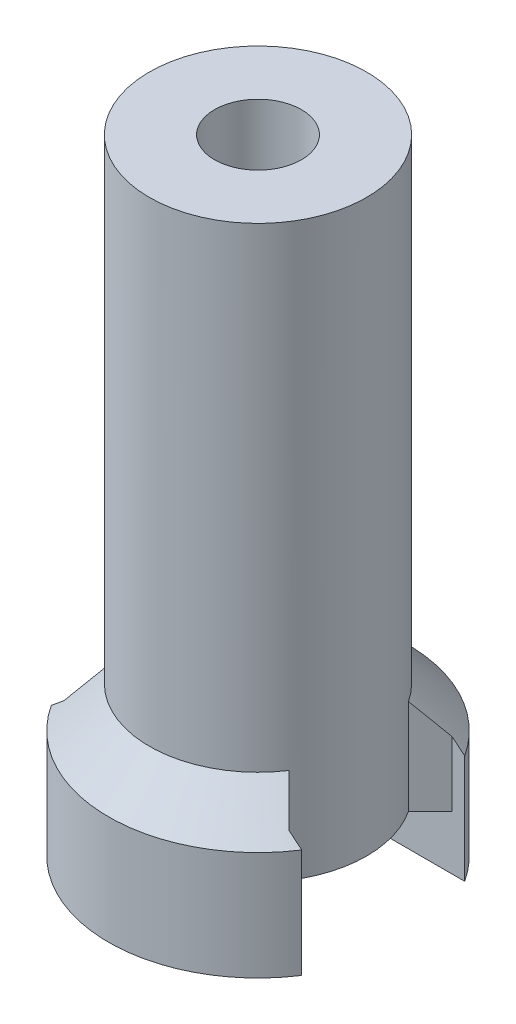
ISO-10303-21;
HEADER;
FILE_DESCRIPTION(('STEP AP214'),'2;1');
FILE_NAME('part.step','',(''),(''),'','','');
FILE_SCHEMA(('AUTOMOTIVE_DESIGN { 1 0 10303 214 1 1 1 1 }'));
ENDSEC;
DATA;
#1=APPLICATION_CONTEXT('core data for automotive mechanical design processes');
#2=APPLICATION_PROTOCOL_DEFINITION('international standard','automotive_design',2000,#1);
#3=PRODUCT_CONTEXT('',#1,'mechanical');
#4=PRODUCT('Part','Part','',(#3));
#5=PRODUCT_RELATED_PRODUCT_CATEGORY('part','',(#4));
#6=PRODUCT_DEFINITION_FORMATION('','',#4);
#7=PRODUCT_DEFINITION_CONTEXT('part definition',#1,'design');
#8=PRODUCT_DEFINITION('design','',#6,#7);
#9=PRODUCT_DEFINITION_SHAPE('','',#8);
#10=(LENGTH_UNIT() NAMED_UNIT(*) SI_UNIT(.MILLI.,.METRE.));
#11=(NAMED_UNIT(*) PLANE_ANGLE_UNIT() SI_UNIT($,.RADIAN.));
#12=(NAMED_UNIT(*) SI_UNIT($,.STERADIAN.) SOLID_ANGLE_UNIT());
#13=UNCERTAINTY_MEASURE_WITH_UNIT(LENGTH_MEASURE(1.E-05),#10,'distance_accuracy_value','');
#14=(GEOMETRIC_REPRESENTATION_CONTEXT(3) GLOBAL_UNCERTAINTY_ASSIGNED_CONTEXT((#13)) GLOBAL_UNIT_ASSIGNED_CONTEXT((#10,
#11,#12)) REPRESENTATION_CONTEXT('',''));
#15=CARTESIAN_POINT('',(0.,0.,0.));
#16=DIRECTION('',(0.,0.,1.));
#17=DIRECTION('',(1.,0.,0.));
#18=AXIS2_PLACEMENT_3D('',#15,#16,#17);
#19=CARTESIAN_POINT('',(0.,0.,0.));
#20=DIRECTION('',(0.,1.,0.));
#21=DIRECTION('',(0.,0.,1.));
#22=AXIS2_PLACEMENT_3D('',#19,#20,#21);
#23=PLANE('',#22);
#24=DIRECTION('',(-1.,0.,0.));
#25=VECTOR('',#24,1.);
#26=CARTESIAN_POINT('',(-6.77796610169491,0.,3.));
#27=LINE('',#26,#25);
#28=CARTESIAN_POINT('',(4.60977222864644,0.,3.));
#29=VERTEX_POINT('',#28);
#30=CARTESIAN_POINT('',(-4.60977222864644,0.,3.));
#31=VERTEX_POINT('',#30);
#32=EDGE_CURVE('E146',#29,#31,#27,.T.);
#33=ORIENTED_EDGE('',*,*,#32,.F.);
#34=CARTESIAN_POINT('',(0.,0.,0.));
#35=DIRECTION('',(0.,-1.,0.));
#36=DIRECTION('',(0.,0.,-1.));
#37=AXIS2_PLACEMENT_3D('',#34,#35,#36);
#38=CIRCLE('',#37,5.5);
#39=EDGE_CURVE('E149',#29,#31,#38,.T.);
#40=ORIENTED_EDGE('',*,*,#39,.T.);
#41=EDGE_LOOP('',(#33,#40));
#42=FACE_BOUND('',#41,.T.);
#43=ADVANCED_FACE('F47',(#42),#23,.F.);
#44=CARTESIAN_POINT('',(0.,23.,0.));
#45=DIRECTION('',(0.,-1.,0.));
#46=DIRECTION('',(0.,0.,-1.));
#47=AXIS2_PLACEMENT_3D('',#44,#45,#46);
#48=CYLINDRICAL_SURFACE('',#47,1.6);
#49=CARTESIAN_POINT('',(0.,23.,0.));
#50=DIRECTION('',(0.,1.,0.));
#51=DIRECTION('',(0.,0.,1.));
#52=AXIS2_PLACEMENT_3D('',#49,#50,#51);
#53=CIRCLE('',#52,1.6);
#54=CARTESIAN_POINT('',(0.,23.,1.6));
#55=VERTEX_POINT('',#54);
#56=EDGE_CURVE('E207',#55,#55,#53,.T.);
#57=ORIENTED_EDGE('',*,*,#56,.T.);
#58=EDGE_LOOP('',(#57));
#59=FACE_BOUND('',#58,.T.);
#60=CARTESIAN_POINT('',(0.,2.,0.));
#61=DIRECTION('',(0.,-1.,0.));
#62=DIRECTION('',(0.,0.,-1.));
#63=AXIS2_PLACEMENT_3D('',#60,#61,#62);
#64=CIRCLE('',#63,1.6);
#65=CARTESIAN_POINT('',(0.,2.,-1.6));
#66=VERTEX_POINT('',#65);
#67=EDGE_CURVE('E188',#66,#66,#64,.T.);
#68=ORIENTED_EDGE('',*,*,#67,.T.);
#69=EDGE_LOOP('',(#68));
#70=FACE_BOUND('',#69,.T.);
#71=ADVANCED_FACE('F346',(#59,#70),#48,.F.);
#72=CARTESIAN_POINT('',(0.,23.,0.));
#73=DIRECTION('',(0.,1.,0.));
#74=DIRECTION('',(0.,0.,1.));
#75=AXIS2_PLACEMENT_3D('',#72,#73,#74);
#76=PLANE('',#75);
#77=CARTESIAN_POINT('',(0.,23.,0.));
#78=DIRECTION('',(0.,1.,0.));
#79=DIRECTION('',(0.,0.,1.));
#80=AXIS2_PLACEMENT_3D('',#77,#78,#79);
#81=CIRCLE('',#80,4.);
#82=CARTESIAN_POINT('',(0.,23.,4.));
#83=VERTEX_POINT('',#82);
#84=EDGE_CURVE('E211',#83,#83,#81,.T.);
#85=ORIENTED_EDGE('',*,*,#84,.T.);
#86=EDGE_LOOP('',(#85));
#87=FACE_BOUND('',#86,.T.);
#88=ORIENTED_EDGE('',*,*,#56,.F.);
#89=EDGE_LOOP('',(#88));
#90=FACE_BOUND('',#89,.T.);
#91=ADVANCED_FACE('F350',(#87,#90),#76,.T.);
#92=DIRECTION('',(1.,0.,0.));
#93=VECTOR('',#92,1.);
#94=CARTESIAN_POINT('',(-6.77796610169491,0.,-3.));
#95=LINE('',#94,#93);
#96=CARTESIAN_POINT('',(-4.60977222864644,0.,-3.));
#97=VERTEX_POINT('',#96);
#98=CARTESIAN_POINT('',(4.60977222864644,0.,-3.));
#99=VERTEX_POINT('',#98);
#100=EDGE_CURVE('E153',#97,#99,#95,.T.);
#101=ORIENTED_EDGE('',*,*,#100,.F.);
#102=CARTESIAN_POINT('',(0.,0.,0.));
#103=DIRECTION('',(0.,-1.,0.));
#104=DIRECTION('',(0.,0.,-1.));
#105=AXIS2_PLACEMENT_3D('',#102,#103,#104);
#106=CIRCLE('',#105,5.5);
#107=EDGE_CURVE('E169',#97,#99,#106,.T.);
#108=ORIENTED_EDGE('',*,*,#107,.T.);
#109=EDGE_LOOP('',(#101,#108));
#110=FACE_BOUND('',#109,.T.);
#111=ADVANCED_FACE('F353',(#110),#23,.F.);
#112=CARTESIAN_POINT('',(0.,23.,0.));
#113=DIRECTION('',(0.,-1.,0.));
#114=DIRECTION('',(0.,0.,-1.));
#115=AXIS2_PLACEMENT_3D('',#112,#113,#114);
#116=CYLINDRICAL_SURFACE('',#115,4.);
#117=CARTESIAN_POINT('',(0.,2.,0.));
#118=DIRECTION('',(0.,-1.,0.));
#119=DIRECTION('',(0.,0.,-1.));
#120=AXIS2_PLACEMENT_3D('',#117,#118,#119);
#121=CIRCLE('',#120,4.);
#122=CARTESIAN_POINT('',(-3.34267952644057,2.,2.19692821537597));
#123=VERTEX_POINT('',#122);
#124=CARTESIAN_POINT('',(-3.34267952644057,2.,-2.19692821537597));
#125=VERTEX_POINT('',#124);
#126=EDGE_CURVE('E200',#123,#125,#121,.T.);
#127=ORIENTED_EDGE('',*,*,#126,.F.);
#128=DIRECTION('',(0.,-1.,0.));
#129=VECTOR('',#128,1.);
#130=CARTESIAN_POINT('',(-3.34267952644057,23.,2.19692821537597));
#131=LINE('',#130,#129);
#132=CARTESIAN_POINT('',(-3.34267952644057,5.5,2.19692821537597));
#133=VERTEX_POINT('',#132);
#134=EDGE_CURVE('E231',#123,#133,#131,.F.);
#135=ORIENTED_EDGE('',*,*,#134,.T.);
#136=CARTESIAN_POINT('',(0.,5.5,0.));
#137=DIRECTION('',(0.,-1.,0.));
#138=DIRECTION('',(0.,0.,-1.));
#139=AXIS2_PLACEMENT_3D('',#136,#137,#138);
#140=CIRCLE('',#139,4.);
#141=CARTESIAN_POINT('',(3.34267952644057,5.5,2.19692821537597));
#142=VERTEX_POINT('',#141);
#143=EDGE_CURVE('E225',#133,#142,#140,.F.);
#144=ORIENTED_EDGE('',*,*,#143,.T.);
#145=DIRECTION('',(0.,-1.,0.));
#146=VECTOR('',#145,1.);
#147=CARTESIAN_POINT('',(3.34267952644057,23.,2.19692821537597));
#148=LINE('',#147,#146);
#149=CARTESIAN_POINT('',(3.34267952644057,2.,2.19692821537597));
#150=VERTEX_POINT('',#149);
#151=EDGE_CURVE('E228',#142,#150,#148,.T.);
#152=ORIENTED_EDGE('',*,*,#151,.T.);
#153=CARTESIAN_POINT('',(3.34267952644057,2.,-2.19692821537597));
#154=VERTEX_POINT('',#153);
#155=EDGE_CURVE('E206',#154,#150,#121,.T.);
#156=ORIENTED_EDGE('',*,*,#155,.F.);
#157=DIRECTION('',(0.,-1.,0.));
#158=VECTOR('',#157,1.);
#159=CARTESIAN_POINT('',(3.34267952644057,23.,-2.19692821537597));
#160=LINE('',#159,#158);
#161=CARTESIAN_POINT('',(3.34267952644057,5.5,-2.19692821537597));
#162=VERTEX_POINT('',#161);
#163=EDGE_CURVE('E218',#154,#162,#160,.F.);
#164=ORIENTED_EDGE('',*,*,#163,.T.);
#165=CARTESIAN_POINT('',(0.,5.5,0.));
#166=DIRECTION('',(0.,-1.,0.));
#167=DIRECTION('',(0.,0.,-1.));
#168=AXIS2_PLACEMENT_3D('',#165,#166,#167);
#169=CIRCLE('',#168,4.);
#170=CARTESIAN_POINT('',(-3.34267952644057,5.5,-2.19692821537597));
#171=VERTEX_POINT('',#170);
#172=EDGE_CURVE('E215',#162,#171,#169,.F.);
#173=ORIENTED_EDGE('',*,*,#172,.T.);
#174=DIRECTION('',(0.,-1.,0.));
#175=VECTOR('',#174,1.);
#176=CARTESIAN_POINT('',(-3.34267952644057,23.,-2.19692821537597));
#177=LINE('',#176,#175);
#178=EDGE_CURVE('E221',#171,#125,#177,.T.);
#179=ORIENTED_EDGE('',*,*,#178,.T.);
#180=EDGE_LOOP('',(#127,#135,#144,#152,#156,#164,#173,#179));
#181=FACE_BOUND('',#180,.T.);
#182=ORIENTED_EDGE('',*,*,#84,.F.);
#183=EDGE_LOOP('',(#182));
#184=FACE_BOUND('',#183,.T.);
#185=ADVANCED_FACE('F325',(#181,#184),#116,.T.);
#186=CARTESIAN_POINT('',(-6.77796610169491,2.,3.));
#187=DIRECTION('',(0.,0.,1.));
#188=DIRECTION('',(1.,0.,0.));
#189=AXIS2_PLACEMENT_3D('',#186,#187,#188);
#190=PLANE('',#189);
#191=DIRECTION('',(0.,-1.,0.));
#192=VECTOR('',#191,1.);
#193=CARTESIAN_POINT('',(-4.60977222864644,4.,3.));
#194=LINE('',#193,#192);
#195=CARTESIAN_POINT('',(-4.60977222864644,4.,3.));
#196=VERTEX_POINT('',#195);
#197=EDGE_CURVE('E164',#196,#31,#194,.T.);
#198=ORIENTED_EDGE('',*,*,#197,.F.);
#199=CARTESIAN_POINT('',(-4.60977222864645,4.,3.00000000000001));
#200=CARTESIAN_POINT('',(-4.53296629669011,4.06441895854077,3.));
#201=CARTESIAN_POINT('',(-4.45589494522464,4.12851605724593,3.));
#202=CARTESIAN_POINT('',(-4.30122130669362,4.25606661463052,3.));
#203=CARTESIAN_POINT('',(-4.22361901896514,4.31952007250606,3.));
#204=CARTESIAN_POINT('',(-4.14575131106459,4.38265166974206,3.));
#205=B_SPLINE_CURVE_WITH_KNOTS('',3,(#199,#200,#201,#202,#203,#204),.UNSPECIFIED.,.F.,.F.,(4,2,
4),(0.,0.300725591714774,0.601451558989797),.UNSPECIFIED.);
#206=CARTESIAN_POINT('',(-4.14575131106459,4.38265166974206,3.));
#207=VERTEX_POINT('',#206);
#208=EDGE_CURVE('E260',#196,#207,#205,.T.);
#209=ORIENTED_EDGE('',*,*,#208,.T.);
#210=DIRECTION('',(0.,-1.,0.));
#211=VECTOR('',#210,1.);
#212=CARTESIAN_POINT('',(-4.14575131106459,2.,3.));
#213=LINE('',#212,#211);
#214=CARTESIAN_POINT('',(-4.14575131106459,2.,3.));
#215=VERTEX_POINT('',#214);
#216=EDGE_CURVE('E242',#207,#215,#213,.T.);
#217=ORIENTED_EDGE('',*,*,#216,.T.);
#218=DIRECTION('',(-1.,0.,0.));
#219=VECTOR('',#218,1.);
#220=CARTESIAN_POINT('',(-6.77796610169491,2.,3.));
#221=LINE('',#220,#219);
#222=CARTESIAN_POINT('',(4.14575131106459,2.,3.));
#223=VERTEX_POINT('',#222);
#224=EDGE_CURVE('E197',#223,#215,#221,.T.);
#225=ORIENTED_EDGE('',*,*,#224,.F.);
#226=DIRECTION('',(0.,1.,0.));
#227=VECTOR('',#226,1.);
#228=CARTESIAN_POINT('',(4.14575131106459,4.,3.));
#229=LINE('',#228,#227);
#230=CARTESIAN_POINT('',(4.14575131106459,4.38265166974206,3.));
#231=VERTEX_POINT('',#230);
#232=EDGE_CURVE('E80',#223,#231,#229,.T.);
#233=ORIENTED_EDGE('',*,*,#232,.T.);
#234=CARTESIAN_POINT('',(4.14575131106459,4.38265166974206,3.));
#235=CARTESIAN_POINT('',(4.22361901896514,4.31952007250606,3.));
#236=CARTESIAN_POINT('',(4.30122130669362,4.25606661463052,3.));
#237=CARTESIAN_POINT('',(4.45589494522464,4.12851605724593,3.));
#238=CARTESIAN_POINT('',(4.53296629669011,4.06441895854077,3.));
#239=CARTESIAN_POINT('',(4.60977222864646,4.,3.));
#240=B_SPLINE_CURVE_WITH_KNOTS('',3,(#234,#235,#236,#237,#238,#239),.UNSPECIFIED.,.F.,.F.,(4,2,
4),(0.,0.300725967275023,0.601451558989797),.UNSPECIFIED.);
#241=CARTESIAN_POINT('',(4.60977222864644,4.,3.));
#242=VERTEX_POINT('',#241);
#243=EDGE_CURVE('E159',#231,#242,#240,.T.);
#244=ORIENTED_EDGE('',*,*,#243,.T.);
#245=DIRECTION('',(0.,-1.,0.));
#246=VECTOR('',#245,1.);
#247=CARTESIAN_POINT('',(4.60977222864644,4.,3.));
#248=LINE('',#247,#246);
#249=EDGE_CURVE('E156',#242,#29,#248,.T.);
#250=ORIENTED_EDGE('',*,*,#249,.T.);
#251=ORIENTED_EDGE('',*,*,#32,.T.);
#252=EDGE_LOOP('',(#198,#209,#217,#225,#233,#244,#250,#251));
#253=FACE_BOUND('',#252,.T.);
#254=ADVANCED_FACE('F157',(#253),#190,.F.);
#255=CARTESIAN_POINT('',(-6.77796610169491,2.,-3.));
#256=DIRECTION('',(0.,0.,-1.));
#257=DIRECTION('',(-1.,0.,0.));
#258=AXIS2_PLACEMENT_3D('',#255,#256,#257);
#259=PLANE('',#258);
#260=DIRECTION('',(1.,0.,0.));
#261=VECTOR('',#260,1.);
#262=CARTESIAN_POINT('',(-6.77796610169491,2.,-3.));
#263=LINE('',#262,#261);
#264=CARTESIAN_POINT('',(-4.14575131106459,2.,-3.));
#265=VERTEX_POINT('',#264);
#266=CARTESIAN_POINT('',(4.1457513110646,2.,-3.));
#267=VERTEX_POINT('',#266);
#268=EDGE_CURVE('E152',#265,#267,#263,.T.);
#269=ORIENTED_EDGE('',*,*,#268,.F.);
#270=DIRECTION('',(0.,1.,0.));
#271=VECTOR('',#270,1.);
#272=CARTESIAN_POINT('',(-4.14575131106459,4.,-3.));
#273=LINE('',#272,#271);
#274=CARTESIAN_POINT('',(-4.14575131106459,4.38265166974206,-3.));
#275=VERTEX_POINT('',#274);
#276=EDGE_CURVE('E237',#265,#275,#273,.T.);
#277=ORIENTED_EDGE('',*,*,#276,.T.);
#278=CARTESIAN_POINT('',(-4.14575131106459,4.38265166974206,-3.));
#279=CARTESIAN_POINT('',(-4.22361901896514,4.31952007250605,-3.));
#280=CARTESIAN_POINT('',(-4.30122130669362,4.25606661463052,-3.));
#281=CARTESIAN_POINT('',(-4.45589494522464,4.12851605724593,-3.));
#282=CARTESIAN_POINT('',(-4.53296629669011,4.06441895854077,-3.));
#283=CARTESIAN_POINT('',(-4.60977222864645,4.,-3.));
#284=B_SPLINE_CURVE_WITH_KNOTS('',3,(#278,#279,#280,#281,#282,#283),.UNSPECIFIED.,.F.,.F.,(4,2,
4),(0.,0.300725967275019,0.60145155898979),.UNSPECIFIED.);
#285=CARTESIAN_POINT('',(-4.60977222864644,4.,-3.));
#286=VERTEX_POINT('',#285);
#287=EDGE_CURVE('E11',#275,#286,#284,.T.);
#288=ORIENTED_EDGE('',*,*,#287,.T.);
#289=DIRECTION('',(0.,-1.,0.));
#290=VECTOR('',#289,1.);
#291=CARTESIAN_POINT('',(-4.60977222864644,4.,-3.));
#292=LINE('',#291,#290);
#293=EDGE_CURVE('E184',#286,#97,#292,.T.);
#294=ORIENTED_EDGE('',*,*,#293,.T.);
#295=ORIENTED_EDGE('',*,*,#100,.T.);
#296=DIRECTION('',(0.,-1.,0.));
#297=VECTOR('',#296,1.);
#298=CARTESIAN_POINT('',(4.60977222864644,4.,-3.));
#299=LINE('',#298,#297);
#300=CARTESIAN_POINT('',(4.60977222864644,4.,-3.));
#301=VERTEX_POINT('',#300);
#302=EDGE_CURVE('E182',#301,#99,#299,.T.);
#303=ORIENTED_EDGE('',*,*,#302,.F.);
#304=CARTESIAN_POINT('',(4.60977222864645,4.,-3.00000000000001));
#305=CARTESIAN_POINT('',(4.53296629669011,4.06441895854077,-3.));
#306=CARTESIAN_POINT('',(4.45589494522464,4.12851605724593,-3.));
#307=CARTESIAN_POINT('',(4.30122130669362,4.25606661463052,-3.));
#308=CARTESIAN_POINT('',(4.22361901896515,4.31952007250605,-3.));
#309=CARTESIAN_POINT('',(4.14575131106459,4.38265166974206,-3.));
#310=B_SPLINE_CURVE_WITH_KNOTS('',3,(#304,#305,#306,#307,#308,#309),.UNSPECIFIED.,.F.,.F.,(4,2,
4),(0.,0.300725591714771,0.60145155898979),.UNSPECIFIED.);
#311=CARTESIAN_POINT('',(4.14575131106459,4.38265166974206,-3.));
#312=VERTEX_POINT('',#311);
#313=EDGE_CURVE('E64',#301,#312,#310,.T.);
#314=ORIENTED_EDGE('',*,*,#313,.T.);
#315=DIRECTION('',(0.,-1.,0.));
#316=VECTOR('',#315,1.);
#317=CARTESIAN_POINT('',(4.14575131106459,2.,-3.));
#318=LINE('',#317,#316);
#319=EDGE_CURVE('E72',#312,#267,#318,.T.);
#320=ORIENTED_EDGE('',*,*,#319,.T.);
#321=EDGE_LOOP('',(#269,#277,#288,#294,#295,#303,#314,#320));
#322=FACE_BOUND('',#321,.T.);
#323=ADVANCED_FACE('F340',(#322),#259,.F.);
#324=CARTESIAN_POINT('',(0.,2.,0.));
#325=DIRECTION('',(0.,-1.,0.));
#326=DIRECTION('',(0.,0.,-1.));
#327=AXIS2_PLACEMENT_3D('',#324,#325,#326);
#328=PLANE('',#327);
#329=ORIENTED_EDGE('',*,*,#67,.F.);
#330=EDGE_LOOP('',(#329));
#331=FACE_BOUND('',#330,.T.);
#332=ORIENTED_EDGE('',*,*,#268,.T.);
#333=DIRECTION('',(0.707106781186544,0.,-0.707106781186551));
#334=VECTOR('',#333,1.);
#335=CARTESIAN_POINT('',(3.34267952644057,2.,-2.19692821537597));
#336=LINE('',#335,#334);
#337=EDGE_CURVE('E257',#267,#154,#336,.F.);
#338=ORIENTED_EDGE('',*,*,#337,.T.);
#339=ORIENTED_EDGE('',*,*,#155,.T.);
#340=DIRECTION('',(0.707106781186544,0.,0.707106781186551));
#341=VECTOR('',#340,1.);
#342=CARTESIAN_POINT('',(3.34267952644057,2.,2.19692821537597));
#343=LINE('',#342,#341);
#344=EDGE_CURVE('E253',#150,#223,#343,.T.);
#345=ORIENTED_EDGE('',*,*,#344,.T.);
#346=ORIENTED_EDGE('',*,*,#224,.T.);
#347=DIRECTION('',(-0.707106781186544,0.,0.707106781186551));
#348=VECTOR('',#347,1.);
#349=CARTESIAN_POINT('',(-3.34267952644057,2.,2.19692821537597));
#350=LINE('',#349,#348);
#351=EDGE_CURVE('E250',#215,#123,#350,.F.);
#352=ORIENTED_EDGE('',*,*,#351,.T.);
#353=ORIENTED_EDGE('',*,*,#126,.T.);
#354=DIRECTION('',(-0.707106781186544,0.,-0.707106781186551));
#355=VECTOR('',#354,1.);
#356=CARTESIAN_POINT('',(-3.34267952644057,2.,-2.19692821537597));
#357=LINE('',#356,#355);
#358=EDGE_CURVE('E246',#125,#265,#357,.T.);
#359=ORIENTED_EDGE('',*,*,#358,.T.);
#360=EDGE_LOOP('',(#332,#338,#339,#345,#346,#352,#353,#359));
#361=FACE_BOUND('',#360,.T.);
#362=ADVANCED_FACE('F344',(#331,#361),#328,.T.);
#363=CARTESIAN_POINT('',(0.,4.,0.));
#364=DIRECTION('',(0.,-1.,0.));
#365=DIRECTION('',(0.,0.,-1.));
#366=AXIS2_PLACEMENT_3D('',#363,#364,#365);
#367=CYLINDRICAL_SURFACE('',#366,5.5);
#368=ORIENTED_EDGE('',*,*,#107,.F.);
#369=ORIENTED_EDGE('',*,*,#293,.F.);
#370=CARTESIAN_POINT('',(0.,4.,0.));
#371=DIRECTION('',(0.,-1.,0.));
#372=DIRECTION('',(0.,0.,-1.));
#373=AXIS2_PLACEMENT_3D('',#370,#371,#372);
#374=CIRCLE('',#373,5.5);
#375=EDGE_CURVE('E175',#286,#301,#374,.T.);
#376=ORIENTED_EDGE('',*,*,#375,.T.);
#377=ORIENTED_EDGE('',*,*,#302,.T.);
#378=EDGE_LOOP('',(#368,#369,#376,#377));
#379=FACE_BOUND('',#378,.T.);
#380=ADVANCED_FACE('F419',(#379),#367,.T.);
#381=CARTESIAN_POINT('',(0.,4.,0.));
#382=DIRECTION('',(0.,-1.,0.));
#383=DIRECTION('',(0.,0.,-1.));
#384=AXIS2_PLACEMENT_3D('',#381,#382,#383);
#385=CYLINDRICAL_SURFACE('',#384,5.5);
#386=ORIENTED_EDGE('',*,*,#39,.F.);
#387=ORIENTED_EDGE('',*,*,#249,.F.);
#388=CARTESIAN_POINT('',(0.,4.,0.));
#389=DIRECTION('',(0.,-1.,0.));
#390=DIRECTION('',(0.,0.,-1.));
#391=AXIS2_PLACEMENT_3D('',#388,#389,#390);
#392=CIRCLE('',#391,5.5);
#393=EDGE_CURVE('E170',#242,#196,#392,.T.);
#394=ORIENTED_EDGE('',*,*,#393,.T.);
#395=ORIENTED_EDGE('',*,*,#197,.T.);
#396=EDGE_LOOP('',(#386,#387,#394,#395));
#397=FACE_BOUND('',#396,.T.);
#398=ADVANCED_FACE('F167',(#397),#385,.T.);
#399=CARTESIAN_POINT('',(3.34267952644057,23.,-2.19692821537597));
#400=DIRECTION('',(0.707106781186551,0.,0.707106781186544));
#401=DIRECTION('',(0.,-1.,0.));
#402=AXIS2_PLACEMENT_3D('',#399,#400,#401);
#403=PLANE('',#402);
#404=ORIENTED_EDGE('',*,*,#319,.F.);
#405=CARTESIAN_POINT('',(3.34267952644057,5.5,-2.19692821537597));
#406=CARTESIAN_POINT('',(3.40975408824548,5.40710621308105,-2.26400277718088));
#407=CARTESIAN_POINT('',(3.47678121466203,5.31414398290259,-2.33102990359743));
#408=CARTESIAN_POINT('',(3.61075530832898,5.12810425960631,-2.46500399726438));
#409=CARTESIAN_POINT('',(3.6777022756626,5.03502676660838,-2.53195096459801));
#410=CARTESIAN_POINT('',(3.811530878782,4.84877798057314,-2.6657795677174));
#411=CARTESIAN_POINT('',(3.87841251459054,4.75560668756857,-2.73266120352595));
#412=CARTESIAN_POINT('',(4.0121207033404,4.56918488697979,-2.8663693922758));
#413=CARTESIAN_POINT('',(4.07894725622461,4.47593437931368,-2.93319594516002));
#414=CARTESIAN_POINT('',(4.14575131106459,4.38265166974206,-3.));
#415=B_SPLINE_CURVE_WITH_KNOTS('',3,(#405,#406,#407,#408,#409,#410,#411,#412,#413,#414),
.UNSPECIFIED.,.F.,.F.,(4,2,2,2,4),(0.,0.398302861438968,0.796605308978851,1.19490761763197,
1.59321033868568),.UNSPECIFIED.);
#416=EDGE_CURVE('E165',#162,#312,#415,.T.);
#417=ORIENTED_EDGE('',*,*,#416,.F.);
#418=ORIENTED_EDGE('',*,*,#163,.F.);
#419=ORIENTED_EDGE('',*,*,#337,.F.);
#420=EDGE_LOOP('',(#404,#417,#418,#419));
#421=FACE_BOUND('',#420,.T.);
#422=ADVANCED_FACE('F288',(#421),#403,.T.);
#423=CARTESIAN_POINT('',(0.,4.,0.));
#424=DIRECTION('',(0.,-1.,0.));
#425=DIRECTION('',(0.,0.,-1.));
#426=AXIS2_PLACEMENT_3D('',#423,#424,#425);
#427=CONICAL_SURFACE('',#426,5.50000000000001,0.785398163397453);
#428=ORIENTED_EDGE('',*,*,#375,.F.);
#429=ORIENTED_EDGE('',*,*,#287,.F.);
#430=CARTESIAN_POINT('',(-4.14575131106459,4.38265166974206,-3.));
#431=CARTESIAN_POINT('',(-4.07894725622461,4.47593437931368,-2.93319594516002));
#432=CARTESIAN_POINT('',(-4.0121207033404,4.56918488697979,-2.8663693922758));
#433=CARTESIAN_POINT('',(-3.87841251459054,4.75560668756857,-2.73266120352595));
#434=CARTESIAN_POINT('',(-3.811530878782,4.84877798057314,-2.6657795677174));
#435=CARTESIAN_POINT('',(-3.67770227566261,5.03502676660837,-2.53195096459801));
#436=CARTESIAN_POINT('',(-3.61075530832898,5.12810425960631,-2.46500399726438));
#437=CARTESIAN_POINT('',(-3.47678121466203,5.31414398290259,-2.33102990359743));
#438=CARTESIAN_POINT('',(-3.40975408824548,5.40710621308105,-2.26400277718088));
#439=CARTESIAN_POINT('',(-3.34267952644057,5.5,-2.19692821537597));
#440=B_SPLINE_CURVE_WITH_KNOTS('',3,(#430,#431,#432,#433,#434,#435,#436,#437,#438,#439),
.UNSPECIFIED.,.F.,.F.,(4,2,2,2,4),(0.,0.398302721053714,0.796605029706832,1.19490747724672,
1.59321033868568),.UNSPECIFIED.);
#441=EDGE_CURVE('E310',#171,#275,#440,.F.);
#442=ORIENTED_EDGE('',*,*,#441,.F.);
#443=ORIENTED_EDGE('',*,*,#172,.F.);
#444=ORIENTED_EDGE('',*,*,#416,.T.);
#445=ORIENTED_EDGE('',*,*,#313,.F.);
#446=EDGE_LOOP('',(#428,#429,#442,#443,#444,#445));
#447=FACE_BOUND('',#446,.T.);
#448=ADVANCED_FACE('F316',(#447),#427,.T.);
#449=CARTESIAN_POINT('',(-3.34267952644057,23.,-2.19692821537597));
#450=DIRECTION('',(0.707106781186551,0.,-0.707106781186544));
#451=DIRECTION('',(0.,-1.,0.));
#452=AXIS2_PLACEMENT_3D('',#449,#450,#451);
#453=PLANE('',#452);
#454=ORIENTED_EDGE('',*,*,#441,.T.);
#455=ORIENTED_EDGE('',*,*,#276,.F.);
#456=ORIENTED_EDGE('',*,*,#358,.F.);
#457=ORIENTED_EDGE('',*,*,#178,.F.);
#458=EDGE_LOOP('',(#454,#455,#456,#457));
#459=FACE_BOUND('',#458,.T.);
#460=ADVANCED_FACE('F323',(#459),#453,.F.);
#461=CARTESIAN_POINT('',(3.34267952644057,23.,2.19692821537597));
#462=DIRECTION('',(-0.707106781186551,0.,0.707106781186544));
#463=DIRECTION('',(0.,-1.,0.));
#464=AXIS2_PLACEMENT_3D('',#461,#462,#463);
#465=PLANE('',#464);
#466=ORIENTED_EDGE('',*,*,#344,.F.);
#467=ORIENTED_EDGE('',*,*,#151,.F.);
#468=CARTESIAN_POINT('',(4.14575131106459,4.38265166974206,3.));
#469=CARTESIAN_POINT('',(4.07894725622461,4.47593437931368,2.93319594516001));
#470=CARTESIAN_POINT('',(4.0121207033404,4.5691848869798,2.8663693922758));
#471=CARTESIAN_POINT('',(3.87841251459054,4.75560668756857,2.73266120352595));
#472=CARTESIAN_POINT('',(3.811530878782,4.84877798057315,2.6657795677174));
#473=CARTESIAN_POINT('',(3.6777022756626,5.03502676660838,2.53195096459801));
#474=CARTESIAN_POINT('',(3.61075530832898,5.12810425960631,2.46500399726438));
#475=CARTESIAN_POINT('',(3.47678121466203,5.31414398290259,2.33102990359743));
#476=CARTESIAN_POINT('',(3.40975408824548,5.40710621308105,2.26400277718088));
#477=CARTESIAN_POINT('',(3.34267952644057,5.5,2.19692821537597));
#478=B_SPLINE_CURVE_WITH_KNOTS('',3,(#468,#469,#470,#471,#472,#473,#474,#475,#476,#477),
.UNSPECIFIED.,.F.,.F.,(4,2,2,2,4),(0.,0.398302721053714,0.796605029706831,1.19490747724671,
1.59321033868568),.UNSPECIFIED.);
#479=EDGE_CURVE('E53',#231,#142,#478,.T.);
#480=ORIENTED_EDGE('',*,*,#479,.F.);
#481=ORIENTED_EDGE('',*,*,#232,.F.);
#482=EDGE_LOOP('',(#466,#467,#480,#481));
#483=FACE_BOUND('',#482,.T.);
#484=ADVANCED_FACE('F50',(#483),#465,.F.);
#485=CARTESIAN_POINT('',(0.,4.,0.));
#486=DIRECTION('',(0.,-1.,0.));
#487=DIRECTION('',(0.,0.,-1.));
#488=AXIS2_PLACEMENT_3D('',#485,#486,#487);
#489=CONICAL_SURFACE('',#488,5.50000000000001,0.785398163397453);
#490=ORIENTED_EDGE('',*,*,#479,.T.);
#491=ORIENTED_EDGE('',*,*,#143,.F.);
#492=CARTESIAN_POINT('',(-3.34267952644057,5.5,2.19692821537597));
#493=CARTESIAN_POINT('',(-3.40975408824548,5.40710621308105,2.26400277718088));
#494=CARTESIAN_POINT('',(-3.47678121466203,5.31414398290259,2.33102990359743));
#495=CARTESIAN_POINT('',(-3.61075530832898,5.12810425960631,2.46500399726438));
#496=CARTESIAN_POINT('',(-3.6777022756626,5.03502676660838,2.53195096459801));
#497=CARTESIAN_POINT('',(-3.811530878782,4.84877798057315,2.6657795677174));
#498=CARTESIAN_POINT('',(-3.87841251459054,4.75560668756857,2.73266120352595));
#499=CARTESIAN_POINT('',(-4.0121207033404,4.5691848869798,2.8663693922758));
#500=CARTESIAN_POINT('',(-4.07894725622461,4.47593437931368,2.93319594516001));
#501=CARTESIAN_POINT('',(-4.14575131106459,4.38265166974206,3.));
#502=B_SPLINE_CURVE_WITH_KNOTS('',3,(#492,#493,#494,#495,#496,#497,#498,#499,#500,#501),
.UNSPECIFIED.,.F.,.F.,(4,2,2,2,4),(0.,0.398302861438967,0.796605308978848,1.19490761763196,
1.59321033868568),.UNSPECIFIED.);
#503=EDGE_CURVE('E294',#207,#133,#502,.F.);
#504=ORIENTED_EDGE('',*,*,#503,.F.);
#505=ORIENTED_EDGE('',*,*,#208,.F.);
#506=ORIENTED_EDGE('',*,*,#393,.F.);
#507=ORIENTED_EDGE('',*,*,#243,.F.);
#508=EDGE_LOOP('',(#490,#491,#504,#505,#506,#507));
#509=FACE_BOUND('',#508,.T.);
#510=ADVANCED_FACE('F278',(#509),#489,.T.);
#511=CARTESIAN_POINT('',(-3.34267952644057,23.,2.19692821537597));
#512=DIRECTION('',(-0.707106781186551,0.,-0.707106781186544));
#513=DIRECTION('',(0.,-1.,0.));
#514=AXIS2_PLACEMENT_3D('',#511,#512,#513);
#515=PLANE('',#514);
#516=ORIENTED_EDGE('',*,*,#351,.F.);
#517=ORIENTED_EDGE('',*,*,#216,.F.);
#518=ORIENTED_EDGE('',*,*,#503,.T.);
#519=ORIENTED_EDGE('',*,*,#134,.F.);
#520=EDGE_LOOP('',(#516,#517,#518,#519));
#521=FACE_BOUND('',#520,.T.);
#522=ADVANCED_FACE('F285',(#521),#515,.T.);
#523=CLOSED_SHELL('',(#43,#71,#91,#111,#185,#254,#323,#362,#380,#398,#422,#448,#460,#484,#510,#522));
#524=MANIFOLD_SOLID_BREP('B2',#523);
#525=ADVANCED_BREP_SHAPE_REPRESENTATION('',(#18,#524),#14);
#526=SHAPE_DEFINITION_REPRESENTATION(#9,#525);
ENDSEC;
END-ISO-10303-21;
